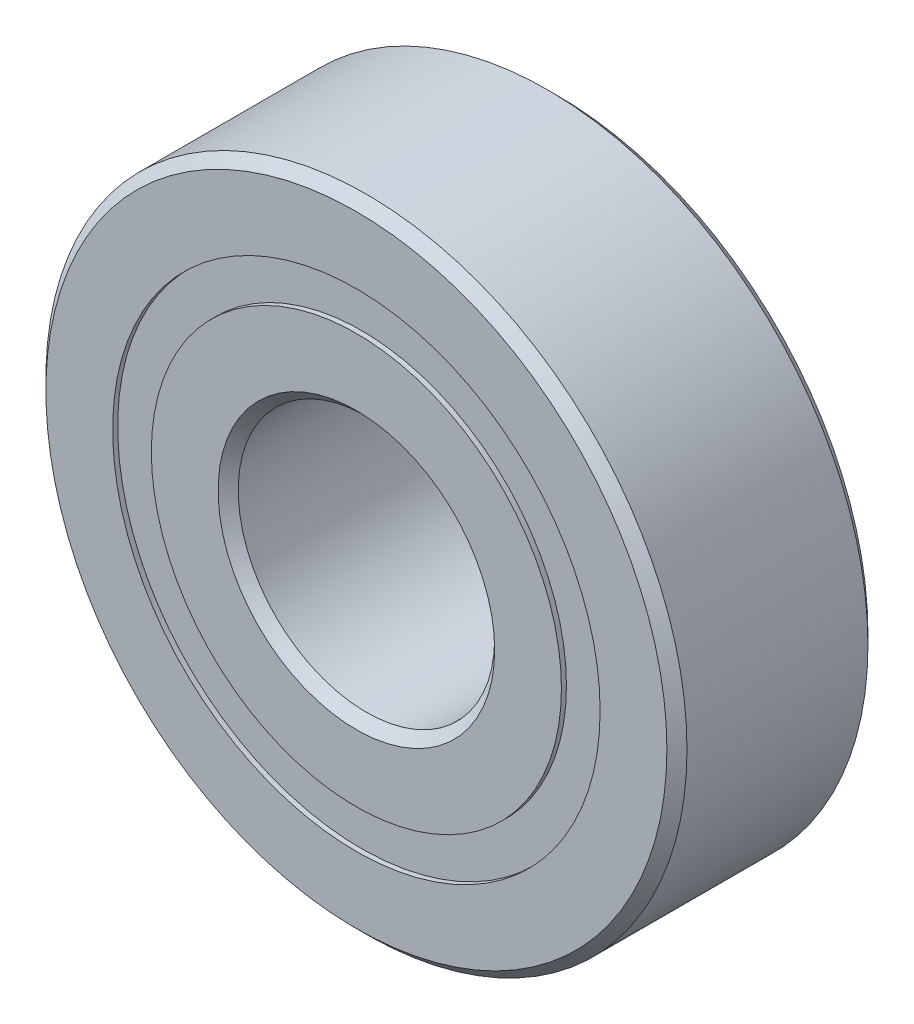
ISO-10303-21;
HEADER;
FILE_DESCRIPTION(('STEP AP214'),'2;1');
FILE_NAME('part.step','',(''),(''),'','','');
FILE_SCHEMA(('AUTOMOTIVE_DESIGN { 1 0 10303 214 1 1 1 1 }'));
ENDSEC;
DATA;
#1=APPLICATION_CONTEXT('core data for automotive mechanical design processes');
#2=APPLICATION_PROTOCOL_DEFINITION('international standard','automotive_design',2000,#1);
#3=PRODUCT_CONTEXT('',#1,'mechanical');
#4=PRODUCT('Part','Part','',(#3));
#5=PRODUCT_RELATED_PRODUCT_CATEGORY('part','',(#4));
#6=PRODUCT_DEFINITION_FORMATION('','',#4);
#7=PRODUCT_DEFINITION_CONTEXT('part definition',#1,'design');
#8=PRODUCT_DEFINITION('design','',#6,#7);
#9=PRODUCT_DEFINITION_SHAPE('','',#8);
#10=(LENGTH_UNIT() NAMED_UNIT(*) SI_UNIT(.MILLI.,.METRE.));
#11=(NAMED_UNIT(*) PLANE_ANGLE_UNIT() SI_UNIT($,.RADIAN.));
#12=(NAMED_UNIT(*) SI_UNIT($,.STERADIAN.) SOLID_ANGLE_UNIT());
#13=UNCERTAINTY_MEASURE_WITH_UNIT(LENGTH_MEASURE(1.E-05),#10,'distance_accuracy_value','');
#14=(GEOMETRIC_REPRESENTATION_CONTEXT(3) GLOBAL_UNCERTAINTY_ASSIGNED_CONTEXT((#13)) GLOBAL_UNIT_ASSIGNED_CONTEXT((#10,
#11,#12)) REPRESENTATION_CONTEXT('',''));
#15=CARTESIAN_POINT('',(0.,0.,0.));
#16=DIRECTION('',(0.,0.,1.));
#17=DIRECTION('',(1.,0.,0.));
#18=AXIS2_PLACEMENT_3D('',#15,#16,#17);
#19=CARTESIAN_POINT('',(0.,6.03522142857143,-2.36474));
#20=DIRECTION('',(0.,0.,1.));
#21=DIRECTION('',(1.,0.,0.));
#22=AXIS2_PLACEMENT_3D('',#19,#20,#21);
#23=PLANE('',#22);
#24=CARTESIAN_POINT('',(0.,0.,-2.36474));
#25=DIRECTION('',(0.,0.,1.));
#26=DIRECTION('',(1.,0.,0.));
#27=AXIS2_PLACEMENT_3D('',#24,#25,#26);
#28=CIRCLE('',#27,6.03522142857143);
#29=CARTESIAN_POINT('',(6.03522142857143,0.,-2.36474));
#30=VERTEX_POINT('',#29);
#31=EDGE_CURVE('E55',#30,#30,#28,.T.);
#32=ORIENTED_EDGE('',*,*,#31,.F.);
#33=EDGE_LOOP('',(#32));
#34=FACE_BOUND('',#33,.T.);
#35=CARTESIAN_POINT('',(0.,0.,-2.36474));
#36=DIRECTION('',(0.,0.,1.));
#37=DIRECTION('',(1.,0.,0.));
#38=AXIS2_PLACEMENT_3D('',#35,#36,#37);
#39=CIRCLE('',#38,5.07727857142857);
#40=CARTESIAN_POINT('',(5.07727857142857,0.,-2.36474));
#41=VERTEX_POINT('',#40);
#42=EDGE_CURVE('E11',#41,#41,#39,.T.);
#43=ORIENTED_EDGE('',*,*,#42,.T.);
#44=EDGE_LOOP('',(#43));
#45=FACE_BOUND('',#44,.T.);
#46=ADVANCED_FACE('F41',(#34,#45),#23,.F.);
#47=CARTESIAN_POINT('',(0.,0.,2.4892));
#48=DIRECTION('',(0.,0.,1.));
#49=DIRECTION('',(1.,0.,0.));
#50=AXIS2_PLACEMENT_3D('',#47,#48,#49);
#51=CYLINDRICAL_SURFACE('',#50,5.07727857142857);
#52=ORIENTED_EDGE('',*,*,#42,.F.);
#53=EDGE_LOOP('',(#52));
#54=FACE_BOUND('',#53,.T.);
#55=CARTESIAN_POINT('',(0.,0.,-1.20554465033679));
#56=DIRECTION('',(0.,0.,1.));
#57=DIRECTION('',(1.,0.,0.));
#58=AXIS2_PLACEMENT_3D('',#55,#56,#57);
#59=CIRCLE('',#58,5.07727857142857);
#60=CARTESIAN_POINT('',(5.07727857142857,0.,-1.20554465033679));
#61=VERTEX_POINT('',#60);
#62=EDGE_CURVE('E47',#61,#61,#59,.T.);
#63=ORIENTED_EDGE('',*,*,#62,.T.);
#64=EDGE_LOOP('',(#63));
#65=FACE_BOUND('',#64,.T.);
#66=ADVANCED_FACE('F64',(#54,#65),#51,.F.);
#67=CARTESIAN_POINT('',(0.,6.03522142857143,-1.20554465033679));
#68=DIRECTION('',(0.,0.,-1.));
#69=DIRECTION('',(-1.,0.,0.));
#70=AXIS2_PLACEMENT_3D('',#67,#68,#69);
#71=PLANE('',#70);
#72=ORIENTED_EDGE('',*,*,#62,.F.);
#73=EDGE_LOOP('',(#72));
#74=FACE_BOUND('',#73,.T.);
#75=CARTESIAN_POINT('',(0.,0.,-1.20554465033679));
#76=DIRECTION('',(0.,0.,1.));
#77=DIRECTION('',(1.,0.,0.));
#78=AXIS2_PLACEMENT_3D('',#75,#76,#77);
#79=CIRCLE('',#78,6.03522142857143);
#80=CARTESIAN_POINT('',(6.03522142857143,0.,-1.20554465033679));
#81=VERTEX_POINT('',#80);
#82=EDGE_CURVE('E51',#81,#81,#79,.T.);
#83=ORIENTED_EDGE('',*,*,#82,.T.);
#84=EDGE_LOOP('',(#83));
#85=FACE_BOUND('',#84,.T.);
#86=ADVANCED_FACE('F68',(#74,#85),#71,.F.);
#87=CARTESIAN_POINT('',(0.,0.,2.4892));
#88=DIRECTION('',(0.,0.,1.));
#89=DIRECTION('',(1.,0.,0.));
#90=AXIS2_PLACEMENT_3D('',#87,#88,#89);
#91=CYLINDRICAL_SURFACE('',#90,6.03522142857143);
#92=ORIENTED_EDGE('',*,*,#82,.F.);
#93=EDGE_LOOP('',(#92));
#94=FACE_BOUND('',#93,.T.);
#95=ORIENTED_EDGE('',*,*,#31,.T.);
#96=EDGE_LOOP('',(#95));
#97=FACE_BOUND('',#96,.T.);
#98=ADVANCED_FACE('F61',(#94,#97),#91,.T.);
#99=CLOSED_SHELL('',(#46,#66,#86,#98));
#100=MANIFOLD_SOLID_BREP('B2',#99);
#101=CARTESIAN_POINT('',(0.,6.03522142857143,2.36474));
#102=DIRECTION('',(0.,0.,-1.));
#103=DIRECTION('',(-1.,0.,0.));
#104=AXIS2_PLACEMENT_3D('',#101,#102,#103);
#105=PLANE('',#104);
#106=CARTESIAN_POINT('',(0.,0.,2.36474));
#107=DIRECTION('',(0.,0.,1.));
#108=DIRECTION('',(1.,0.,0.));
#109=AXIS2_PLACEMENT_3D('',#106,#107,#108);
#110=CIRCLE('',#109,5.07727857142857);
#111=CARTESIAN_POINT('',(5.07727857142857,0.,2.36474));
#112=VERTEX_POINT('',#111);
#113=EDGE_CURVE('E40',#112,#112,#110,.T.);
#114=ORIENTED_EDGE('',*,*,#113,.F.);
#115=EDGE_LOOP('',(#114));
#116=FACE_BOUND('',#115,.T.);
#117=CARTESIAN_POINT('',(0.,0.,2.36474));
#118=DIRECTION('',(0.,0.,1.));
#119=DIRECTION('',(1.,0.,0.));
#120=AXIS2_PLACEMENT_3D('',#117,#118,#119);
#121=CIRCLE('',#120,6.03522142857143);
#122=CARTESIAN_POINT('',(6.03522142857143,0.,2.36474));
#123=VERTEX_POINT('',#122);
#124=EDGE_CURVE('E122',#123,#123,#121,.T.);
#125=ORIENTED_EDGE('',*,*,#124,.T.);
#126=EDGE_LOOP('',(#125));
#127=FACE_BOUND('',#126,.T.);
#128=ADVANCED_FACE('F108',(#116,#127),#105,.F.);
#129=CARTESIAN_POINT('',(0.,0.,2.4892));
#130=DIRECTION('',(0.,0.,1.));
#131=DIRECTION('',(1.,0.,0.));
#132=AXIS2_PLACEMENT_3D('',#129,#130,#131);
#133=CYLINDRICAL_SURFACE('',#132,5.07727857142857);
#134=CARTESIAN_POINT('',(0.,0.,1.20554465033679));
#135=DIRECTION('',(0.,0.,1.));
#136=DIRECTION('',(1.,0.,0.));
#137=AXIS2_PLACEMENT_3D('',#134,#135,#136);
#138=CIRCLE('',#137,5.07727857142857);
#139=CARTESIAN_POINT('',(5.07727857142857,0.,1.20554465033679));
#140=VERTEX_POINT('',#139);
#141=EDGE_CURVE('E114',#140,#140,#138,.T.);
#142=ORIENTED_EDGE('',*,*,#141,.F.);
#143=EDGE_LOOP('',(#142));
#144=FACE_BOUND('',#143,.T.);
#145=ORIENTED_EDGE('',*,*,#113,.T.);
#146=EDGE_LOOP('',(#145));
#147=FACE_BOUND('',#146,.T.);
#148=ADVANCED_FACE('F137',(#144,#147),#133,.F.);
#149=CARTESIAN_POINT('',(0.,6.03522142857143,1.20554465033679));
#150=DIRECTION('',(0.,0.,1.));
#151=DIRECTION('',(1.,0.,0.));
#152=AXIS2_PLACEMENT_3D('',#149,#150,#151);
#153=PLANE('',#152);
#154=CARTESIAN_POINT('',(0.,0.,1.20554465033679));
#155=DIRECTION('',(0.,0.,1.));
#156=DIRECTION('',(1.,0.,0.));
#157=AXIS2_PLACEMENT_3D('',#154,#155,#156);
#158=CIRCLE('',#157,6.03522142857143);
#159=CARTESIAN_POINT('',(6.03522142857143,0.,1.20554465033679));
#160=VERTEX_POINT('',#159);
#161=EDGE_CURVE('E118',#160,#160,#158,.T.);
#162=ORIENTED_EDGE('',*,*,#161,.F.);
#163=EDGE_LOOP('',(#162));
#164=FACE_BOUND('',#163,.T.);
#165=ORIENTED_EDGE('',*,*,#141,.T.);
#166=EDGE_LOOP('',(#165));
#167=FACE_BOUND('',#166,.T.);
#168=ADVANCED_FACE('F132',(#164,#167),#153,.F.);
#169=CARTESIAN_POINT('',(0.,0.,2.4892));
#170=DIRECTION('',(0.,0.,1.));
#171=DIRECTION('',(1.,0.,0.));
#172=AXIS2_PLACEMENT_3D('',#169,#170,#171);
#173=CYLINDRICAL_SURFACE('',#172,6.03522142857143);
#174=ORIENTED_EDGE('',*,*,#124,.F.);
#175=EDGE_LOOP('',(#174));
#176=FACE_BOUND('',#175,.T.);
#177=ORIENTED_EDGE('',*,*,#161,.T.);
#178=EDGE_LOOP('',(#177));
#179=FACE_BOUND('',#178,.T.);
#180=ADVANCED_FACE('F129',(#176,#179),#173,.T.);
#181=CLOSED_SHELL('',(#128,#148,#168,#180));
#182=MANIFOLD_SOLID_BREP('B6',#181);
#183=CARTESIAN_POINT('',(-3.92886205296771,3.9288620529678,0.));
#184=DIRECTION('',(0.,0.,1.));
#185=DIRECTION('',(-0.707106781186539,0.707106781186556,0.));
#186=AXIS2_PLACEMENT_3D('',#183,#184,#185);
#187=SPHERICAL_SURFACE('',#186,1.20554465033679);
#188=CARTESIAN_POINT('',(-3.92886205296771,3.9288620529678,1.20554465033679));
#189=VERTEX_POINT('',#188);
#190=VERTEX_LOOP('',#189);
#191=FACE_BOUND('',#190,.T.);
#192=ADVANCED_FACE('F175',(#191),#187,.T.);
#193=CLOSED_SHELL('',(#192));
#194=MANIFOLD_SOLID_BREP('B35',#193);
#195=CARTESIAN_POINT('',(-5.55625,0.,0.));
#196=DIRECTION('',(0.,0.,1.));
#197=DIRECTION('',(-1.,0.,0.));
#198=AXIS2_PLACEMENT_3D('',#195,#196,#197);
#199=SPHERICAL_SURFACE('',#198,1.20554465033679);
#200=CARTESIAN_POINT('',(-5.55625,0.,1.20554465033679));
#201=VERTEX_POINT('',#200);
#202=VERTEX_LOOP('',#201);
#203=FACE_BOUND('',#202,.T.);
#204=ADVANCED_FACE('F195',(#203),#199,.T.);
#205=CLOSED_SHELL('',(#204));
#206=MANIFOLD_SOLID_BREP('B104',#205);
#207=CARTESIAN_POINT('',(-3.92886205296779,-3.92886205296772,0.));
#208=DIRECTION('',(0.,0.,1.));
#209=DIRECTION('',(-0.707106781186554,-0.707106781186541,0.));
#210=AXIS2_PLACEMENT_3D('',#207,#208,#209);
#211=SPHERICAL_SURFACE('',#210,1.20554465033679);
#212=CARTESIAN_POINT('',(-3.92886205296779,-3.92886205296772,1.20554465033679));
#213=VERTEX_POINT('',#212);
#214=VERTEX_LOOP('',#213);
#215=FACE_BOUND('',#214,.T.);
#216=ADVANCED_FACE('F215',(#215),#211,.T.);
#217=CLOSED_SHELL('',(#216));
#218=MANIFOLD_SOLID_BREP('B171',#217);
#219=CARTESIAN_POINT('',(0.,-5.55625,0.));
#220=DIRECTION('',(0.,0.,1.));
#221=DIRECTION('',(0.,-1.,0.));
#222=AXIS2_PLACEMENT_3D('',#219,#220,#221);
#223=SPHERICAL_SURFACE('',#222,1.20554465033679);
#224=CARTESIAN_POINT('',(0.,-5.55625,1.20554465033679));
#225=VERTEX_POINT('',#224);
#226=VERTEX_LOOP('',#225);
#227=FACE_BOUND('',#226,.T.);
#228=ADVANCED_FACE('F235',(#227),#223,.T.);
#229=CLOSED_SHELL('',(#228));
#230=MANIFOLD_SOLID_BREP('B191',#229);
#231=CARTESIAN_POINT('',(3.92886205296773,-3.92886205296778,0.));
#232=DIRECTION('',(0.,0.,1.));
#233=DIRECTION('',(0.707106781186544,-0.707106781186551,0.));
#234=AXIS2_PLACEMENT_3D('',#231,#232,#233);
#235=SPHERICAL_SURFACE('',#234,1.20554465033679);
#236=CARTESIAN_POINT('',(3.92886205296773,-3.92886205296778,1.20554465033679));
#237=VERTEX_POINT('',#236);
#238=VERTEX_LOOP('',#237);
#239=FACE_BOUND('',#238,.T.);
#240=ADVANCED_FACE('F255',(#239),#235,.T.);
#241=CLOSED_SHELL('',(#240));
#242=MANIFOLD_SOLID_BREP('B211',#241);
#243=CARTESIAN_POINT('',(5.55625,0.,0.));
#244=DIRECTION('',(0.,0.,1.));
#245=DIRECTION('',(1.,0.,0.));
#246=AXIS2_PLACEMENT_3D('',#243,#244,#245);
#247=SPHERICAL_SURFACE('',#246,1.20554465033679);
#248=CARTESIAN_POINT('',(5.55625,0.,1.20554465033679));
#249=VERTEX_POINT('',#248);
#250=VERTEX_LOOP('',#249);
#251=FACE_BOUND('',#250,.T.);
#252=ADVANCED_FACE('F275',(#251),#247,.T.);
#253=CLOSED_SHELL('',(#252));
#254=MANIFOLD_SOLID_BREP('B231',#253);
#255=CARTESIAN_POINT('',(3.92886205296776,3.92886205296775,0.));
#256=DIRECTION('',(0.,0.,1.));
#257=DIRECTION('',(0.707106781186549,0.707106781186546,0.));
#258=AXIS2_PLACEMENT_3D('',#255,#256,#257);
#259=SPHERICAL_SURFACE('',#258,1.20554465033679);
#260=CARTESIAN_POINT('',(3.92886205296776,3.92886205296775,1.20554465033679));
#261=VERTEX_POINT('',#260);
#262=VERTEX_LOOP('',#261);
#263=FACE_BOUND('',#262,.T.);
#264=ADVANCED_FACE('F295',(#263),#259,.T.);
#265=CLOSED_SHELL('',(#264));
#266=MANIFOLD_SOLID_BREP('B251',#265);
#267=CARTESIAN_POINT('',(0.,5.55625,0.));
#268=DIRECTION('',(0.,0.,1.));
#269=DIRECTION('',(0.,1.,0.));
#270=AXIS2_PLACEMENT_3D('',#267,#268,#269);
#271=SPHERICAL_SURFACE('',#270,1.20554465033679);
#272=CARTESIAN_POINT('',(0.,5.55625,1.20554465033679));
#273=VERTEX_POINT('',#272);
#274=VERTEX_LOOP('',#273);
#275=FACE_BOUND('',#274,.T.);
#276=ADVANCED_FACE('F317',(#275),#271,.T.);
#277=CLOSED_SHELL('',(#276));
#278=MANIFOLD_SOLID_BREP('B271',#277);
#279=CARTESIAN_POINT('',(0.,5.07727857142857,2.4892));
#280=DIRECTION('',(0.,0.,-1.));
#281=DIRECTION('',(-1.,0.,0.));
#282=AXIS2_PLACEMENT_3D('',#279,#280,#281);
#283=PLANE('',#282);
#284=CARTESIAN_POINT('',(0.,0.,2.4892));
#285=DIRECTION('',(0.,0.,1.));
#286=DIRECTION('',(1.,0.,0.));
#287=AXIS2_PLACEMENT_3D('',#284,#285,#286);
#288=CIRCLE('',#287,3.42392);
#289=CARTESIAN_POINT('',(3.42392,0.,2.4892));
#290=VERTEX_POINT('',#289);
#291=EDGE_CURVE('E364',#290,#290,#288,.T.);
#292=ORIENTED_EDGE('',*,*,#291,.F.);
#293=EDGE_LOOP('',(#292));
#294=FACE_BOUND('',#293,.T.);
#295=CARTESIAN_POINT('',(0.,0.,2.4892));
#296=DIRECTION('',(0.,0.,1.));
#297=DIRECTION('',(1.,0.,0.));
#298=AXIS2_PLACEMENT_3D('',#295,#296,#297);
#299=CIRCLE('',#298,5.07727857142857);
#300=CARTESIAN_POINT('',(5.07727857142857,0.,2.4892));
#301=VERTEX_POINT('',#300);
#302=EDGE_CURVE('E316',#301,#301,#299,.T.);
#303=ORIENTED_EDGE('',*,*,#302,.T.);
#304=EDGE_LOOP('',(#303));
#305=FACE_BOUND('',#304,.T.);
#306=ADVANCED_FACE('F336',(#294,#305),#283,.F.);
#307=CARTESIAN_POINT('',(0.,0.,2.4892));
#308=DIRECTION('',(0.,0.,1.));
#309=DIRECTION('',(1.,0.,0.));
#310=AXIS2_PLACEMENT_3D('',#307,#308,#309);
#311=CYLINDRICAL_SURFACE('',#310,5.07727857142857);
#312=ORIENTED_EDGE('',*,*,#302,.F.);
#313=EDGE_LOOP('',(#312));
#314=FACE_BOUND('',#313,.T.);
#315=CARTESIAN_POINT('',(0.,0.,1.10631111111111));
#316=DIRECTION('',(0.,0.,1.));
#317=DIRECTION('',(1.,0.,0.));
#318=AXIS2_PLACEMENT_3D('',#315,#316,#317);
#319=CIRCLE('',#318,5.07727857142857);
#320=CARTESIAN_POINT('',(5.07727857142857,0.,1.10631111111111));
#321=VERTEX_POINT('',#320);
#322=EDGE_CURVE('E342',#321,#321,#319,.T.);
#323=ORIENTED_EDGE('',*,*,#322,.T.);
#324=EDGE_LOOP('',(#323));
#325=FACE_BOUND('',#324,.T.);
#326=ADVANCED_FACE('F371',(#314,#325),#311,.T.);
#327=CARTESIAN_POINT('',(0.,0.,0.));
#328=DIRECTION('',(0.,0.,1.));
#329=DIRECTION('',(1.,0.,0.));
#330=AXIS2_PLACEMENT_3D('',#327,#328,#329);
#331=TOROIDAL_SURFACE('',#330,5.55625,1.20554465033679);
#332=ORIENTED_EDGE('',*,*,#322,.F.);
#333=EDGE_LOOP('',(#332));
#334=FACE_BOUND('',#333,.T.);
#335=CARTESIAN_POINT('',(0.,0.,-1.10631111111111));
#336=DIRECTION('',(0.,0.,1.));
#337=DIRECTION('',(1.,0.,0.));
#338=AXIS2_PLACEMENT_3D('',#335,#336,#337);
#339=CIRCLE('',#338,5.07727857142857);
#340=CARTESIAN_POINT('',(5.07727857142857,0.,-1.10631111111111));
#341=VERTEX_POINT('',#340);
#342=EDGE_CURVE('E346',#341,#341,#339,.T.);
#343=ORIENTED_EDGE('',*,*,#342,.T.);
#344=EDGE_LOOP('',(#343));
#345=FACE_BOUND('',#344,.T.);
#346=ADVANCED_FACE('F375',(#334,#345),#331,.F.);
#347=CARTESIAN_POINT('',(0.,0.,2.4892));
#348=DIRECTION('',(0.,0.,1.));
#349=DIRECTION('',(1.,0.,0.));
#350=AXIS2_PLACEMENT_3D('',#347,#348,#349);
#351=CYLINDRICAL_SURFACE('',#350,5.07727857142857);
#352=ORIENTED_EDGE('',*,*,#342,.F.);
#353=EDGE_LOOP('',(#352));
#354=FACE_BOUND('',#353,.T.);
#355=CARTESIAN_POINT('',(0.,0.,-2.4892));
#356=DIRECTION('',(0.,0.,1.));
#357=DIRECTION('',(1.,0.,0.));
#358=AXIS2_PLACEMENT_3D('',#355,#356,#357);
#359=CIRCLE('',#358,5.07727857142857);
#360=CARTESIAN_POINT('',(5.07727857142857,0.,-2.4892));
#361=VERTEX_POINT('',#360);
#362=EDGE_CURVE('E350',#361,#361,#359,.T.);
#363=ORIENTED_EDGE('',*,*,#362,.T.);
#364=EDGE_LOOP('',(#363));
#365=FACE_BOUND('',#364,.T.);
#366=ADVANCED_FACE('F380',(#354,#365),#351,.T.);
#367=CARTESIAN_POINT('',(0.,3.42392,-2.4892));
#368=DIRECTION('',(0.,0.,1.));
#369=DIRECTION('',(1.,0.,0.));
#370=AXIS2_PLACEMENT_3D('',#367,#368,#369);
#371=PLANE('',#370);
#372=ORIENTED_EDGE('',*,*,#362,.F.);
#373=EDGE_LOOP('',(#372));
#374=FACE_BOUND('',#373,.T.);
#375=CARTESIAN_POINT('',(0.,0.,-2.4892));
#376=DIRECTION('',(0.,0.,1.));
#377=DIRECTION('',(1.,0.,0.));
#378=AXIS2_PLACEMENT_3D('',#375,#376,#377);
#379=CIRCLE('',#378,3.42392);
#380=CARTESIAN_POINT('',(3.42392,0.,-2.4892));
#381=VERTEX_POINT('',#380);
#382=EDGE_CURVE('E355',#381,#381,#379,.T.);
#383=ORIENTED_EDGE('',*,*,#382,.T.);
#384=EDGE_LOOP('',(#383));
#385=FACE_BOUND('',#384,.T.);
#386=ADVANCED_FACE('F386',(#374,#385),#371,.F.);
#387=CARTESIAN_POINT('',(0.,0.,-2.24028));
#388=DIRECTION('',(0.,0.,-1.));
#389=DIRECTION('',(-1.,0.,0.));
#390=AXIS2_PLACEMENT_3D('',#387,#388,#389);
#391=CONICAL_SURFACE('',#390,3.175,0.785398163397447);
#392=ORIENTED_EDGE('',*,*,#382,.F.);
#393=EDGE_LOOP('',(#392));
#394=FACE_BOUND('',#393,.T.);
#395=CARTESIAN_POINT('',(0.,0.,-2.24028));
#396=DIRECTION('',(0.,0.,1.));
#397=DIRECTION('',(1.,0.,0.));
#398=AXIS2_PLACEMENT_3D('',#395,#396,#397);
#399=CIRCLE('',#398,3.175);
#400=CARTESIAN_POINT('',(3.175,0.,-2.24028));
#401=VERTEX_POINT('',#400);
#402=EDGE_CURVE('E358',#401,#401,#399,.T.);
#403=ORIENTED_EDGE('',*,*,#402,.T.);
#404=EDGE_LOOP('',(#403));
#405=FACE_BOUND('',#404,.T.);
#406=ADVANCED_FACE('F390',(#394,#405),#391,.F.);
#407=CARTESIAN_POINT('',(0.,0.,2.4892));
#408=DIRECTION('',(0.,0.,1.));
#409=DIRECTION('',(1.,0.,0.));
#410=AXIS2_PLACEMENT_3D('',#407,#408,#409);
#411=CYLINDRICAL_SURFACE('',#410,3.175);
#412=ORIENTED_EDGE('',*,*,#402,.F.);
#413=EDGE_LOOP('',(#412));
#414=FACE_BOUND('',#413,.T.);
#415=CARTESIAN_POINT('',(0.,0.,2.24028));
#416=DIRECTION('',(0.,0.,1.));
#417=DIRECTION('',(1.,0.,0.));
#418=AXIS2_PLACEMENT_3D('',#415,#416,#417);
#419=CIRCLE('',#418,3.175);
#420=CARTESIAN_POINT('',(3.175,0.,2.24028));
#421=VERTEX_POINT('',#420);
#422=EDGE_CURVE('E361',#421,#421,#419,.T.);
#423=ORIENTED_EDGE('',*,*,#422,.T.);
#424=EDGE_LOOP('',(#423));
#425=FACE_BOUND('',#424,.T.);
#426=ADVANCED_FACE('F394',(#414,#425),#411,.F.);
#427=CARTESIAN_POINT('',(0.,0.,2.4892));
#428=DIRECTION('',(0.,0.,1.));
#429=DIRECTION('',(1.,0.,0.));
#430=AXIS2_PLACEMENT_3D('',#427,#428,#429);
#431=CONICAL_SURFACE('',#430,3.42392,0.785398163397451);
#432=ORIENTED_EDGE('',*,*,#422,.F.);
#433=EDGE_LOOP('',(#432));
#434=FACE_BOUND('',#433,.T.);
#435=ORIENTED_EDGE('',*,*,#291,.T.);
#436=EDGE_LOOP('',(#435));
#437=FACE_BOUND('',#436,.T.);
#438=ADVANCED_FACE('F368',(#434,#437),#431,.F.);
#439=CLOSED_SHELL('',(#306,#326,#346,#366,#386,#406,#426,#438));
#440=MANIFOLD_SOLID_BREP('B291',#439);
#441=CARTESIAN_POINT('',(0.,0.,2.24028));
#442=DIRECTION('',(0.,0.,-1.));
#443=DIRECTION('',(-1.,0.,0.));
#444=AXIS2_PLACEMENT_3D('',#441,#442,#443);
#445=CONICAL_SURFACE('',#444,7.9375,0.785398163397447);
#446=CARTESIAN_POINT('',(0.,0.,2.4892));
#447=DIRECTION('',(0.,0.,1.));
#448=DIRECTION('',(1.,0.,0.));
#449=AXIS2_PLACEMENT_3D('',#446,#447,#448);
#450=CIRCLE('',#449,7.68858);
#451=CARTESIAN_POINT('',(7.68858,0.,2.4892));
#452=VERTEX_POINT('',#451);
#453=EDGE_CURVE('E485',#452,#452,#450,.T.);
#454=ORIENTED_EDGE('',*,*,#453,.F.);
#455=EDGE_LOOP('',(#454));
#456=FACE_BOUND('',#455,.T.);
#457=CARTESIAN_POINT('',(0.,0.,2.24028));
#458=DIRECTION('',(0.,0.,1.));
#459=DIRECTION('',(1.,0.,0.));
#460=AXIS2_PLACEMENT_3D('',#457,#458,#459);
#461=CIRCLE('',#460,7.9375);
#462=CARTESIAN_POINT('',(7.9375,0.,2.24028));
#463=VERTEX_POINT('',#462);
#464=EDGE_CURVE('E335',#463,#463,#461,.T.);
#465=ORIENTED_EDGE('',*,*,#464,.T.);
#466=EDGE_LOOP('',(#465));
#467=FACE_BOUND('',#466,.T.);
#468=ADVANCED_FACE('F457',(#456,#467),#445,.T.);
#469=CARTESIAN_POINT('',(0.,0.,2.4892));
#470=DIRECTION('',(0.,0.,1.));
#471=DIRECTION('',(1.,0.,0.));
#472=AXIS2_PLACEMENT_3D('',#469,#470,#471);
#473=CYLINDRICAL_SURFACE('',#472,7.9375);
#474=ORIENTED_EDGE('',*,*,#464,.F.);
#475=EDGE_LOOP('',(#474));
#476=FACE_BOUND('',#475,.T.);
#477=CARTESIAN_POINT('',(0.,0.,-2.24028));
#478=DIRECTION('',(0.,0.,1.));
#479=DIRECTION('',(1.,0.,0.));
#480=AXIS2_PLACEMENT_3D('',#477,#478,#479);
#481=CIRCLE('',#480,7.9375);
#482=CARTESIAN_POINT('',(7.9375,0.,-2.24028));
#483=VERTEX_POINT('',#482);
#484=EDGE_CURVE('E463',#483,#483,#481,.T.);
#485=ORIENTED_EDGE('',*,*,#484,.T.);
#486=EDGE_LOOP('',(#485));
#487=FACE_BOUND('',#486,.T.);
#488=ADVANCED_FACE('F492',(#476,#487),#473,.T.);
#489=CARTESIAN_POINT('',(0.,0.,-2.4892));
#490=DIRECTION('',(0.,0.,1.));
#491=DIRECTION('',(1.,0.,0.));
#492=AXIS2_PLACEMENT_3D('',#489,#490,#491);
#493=CONICAL_SURFACE('',#492,7.68858,0.785398163397447);
#494=ORIENTED_EDGE('',*,*,#484,.F.);
#495=EDGE_LOOP('',(#494));
#496=FACE_BOUND('',#495,.T.);
#497=CARTESIAN_POINT('',(0.,0.,-2.4892));
#498=DIRECTION('',(0.,0.,1.));
#499=DIRECTION('',(1.,0.,0.));
#500=AXIS2_PLACEMENT_3D('',#497,#498,#499);
#501=CIRCLE('',#500,7.68858);
#502=CARTESIAN_POINT('',(7.68858,0.,-2.4892));
#503=VERTEX_POINT('',#502);
#504=EDGE_CURVE('E467',#503,#503,#501,.T.);
#505=ORIENTED_EDGE('',*,*,#504,.T.);
#506=EDGE_LOOP('',(#505));
#507=FACE_BOUND('',#506,.T.);
#508=ADVANCED_FACE('F496',(#496,#507),#493,.T.);
#509=CARTESIAN_POINT('',(0.,7.68858,-2.4892));
#510=DIRECTION('',(0.,0.,1.));
#511=DIRECTION('',(1.,0.,0.));
#512=AXIS2_PLACEMENT_3D('',#509,#510,#511);
#513=PLANE('',#512);
#514=ORIENTED_EDGE('',*,*,#504,.F.);
#515=EDGE_LOOP('',(#514));
#516=FACE_BOUND('',#515,.T.);
#517=CARTESIAN_POINT('',(0.,0.,-2.4892));
#518=DIRECTION('',(0.,0.,1.));
#519=DIRECTION('',(1.,0.,0.));
#520=AXIS2_PLACEMENT_3D('',#517,#518,#519);
#521=CIRCLE('',#520,6.03522142857143);
#522=CARTESIAN_POINT('',(6.03522142857143,0.,-2.4892));
#523=VERTEX_POINT('',#522);
#524=EDGE_CURVE('E471',#523,#523,#521,.T.);
#525=ORIENTED_EDGE('',*,*,#524,.T.);
#526=EDGE_LOOP('',(#525));
#527=FACE_BOUND('',#526,.T.);
#528=ADVANCED_FACE('F501',(#516,#527),#513,.F.);
#529=CARTESIAN_POINT('',(0.,0.,2.4892));
#530=DIRECTION('',(0.,0.,1.));
#531=DIRECTION('',(1.,0.,0.));
#532=AXIS2_PLACEMENT_3D('',#529,#530,#531);
#533=CYLINDRICAL_SURFACE('',#532,6.03522142857143);
#534=ORIENTED_EDGE('',*,*,#524,.F.);
#535=EDGE_LOOP('',(#534));
#536=FACE_BOUND('',#535,.T.);
#537=CARTESIAN_POINT('',(0.,0.,-1.10631111111111));
#538=DIRECTION('',(0.,0.,1.));
#539=DIRECTION('',(1.,0.,0.));
#540=AXIS2_PLACEMENT_3D('',#537,#538,#539);
#541=CIRCLE('',#540,6.03522142857143);
#542=CARTESIAN_POINT('',(6.03522142857143,0.,-1.10631111111111));
#543=VERTEX_POINT('',#542);
#544=EDGE_CURVE('E476',#543,#543,#541,.T.);
#545=ORIENTED_EDGE('',*,*,#544,.T.);
#546=EDGE_LOOP('',(#545));
#547=FACE_BOUND('',#546,.T.);
#548=ADVANCED_FACE('F507',(#536,#547),#533,.F.);
#549=CARTESIAN_POINT('',(0.,0.,0.));
#550=DIRECTION('',(0.,0.,1.));
#551=DIRECTION('',(1.,0.,0.));
#552=AXIS2_PLACEMENT_3D('',#549,#550,#551);
#553=TOROIDAL_SURFACE('',#552,5.55625,1.20554465033679);
#554=ORIENTED_EDGE('',*,*,#544,.F.);
#555=EDGE_LOOP('',(#554));
#556=FACE_BOUND('',#555,.T.);
#557=CARTESIAN_POINT('',(0.,0.,1.10631111111111));
#558=DIRECTION('',(0.,0.,1.));
#559=DIRECTION('',(1.,0.,0.));
#560=AXIS2_PLACEMENT_3D('',#557,#558,#559);
#561=CIRCLE('',#560,6.03522142857143);
#562=CARTESIAN_POINT('',(6.03522142857143,0.,1.10631111111111));
#563=VERTEX_POINT('',#562);
#564=EDGE_CURVE('E479',#563,#563,#561,.T.);
#565=ORIENTED_EDGE('',*,*,#564,.T.);
#566=EDGE_LOOP('',(#565));
#567=FACE_BOUND('',#566,.T.);
#568=ADVANCED_FACE('F511',(#556,#567),#553,.F.);
#569=CARTESIAN_POINT('',(0.,0.,2.4892));
#570=DIRECTION('',(0.,0.,1.));
#571=DIRECTION('',(1.,0.,0.));
#572=AXIS2_PLACEMENT_3D('',#569,#570,#571);
#573=CYLINDRICAL_SURFACE('',#572,6.03522142857143);
#574=ORIENTED_EDGE('',*,*,#564,.F.);
#575=EDGE_LOOP('',(#574));
#576=FACE_BOUND('',#575,.T.);
#577=CARTESIAN_POINT('',(0.,0.,2.4892));
#578=DIRECTION('',(0.,0.,1.));
#579=DIRECTION('',(1.,0.,0.));
#580=AXIS2_PLACEMENT_3D('',#577,#578,#579);
#581=CIRCLE('',#580,6.03522142857143);
#582=CARTESIAN_POINT('',(6.03522142857143,0.,2.4892));
#583=VERTEX_POINT('',#582);
#584=EDGE_CURVE('E482',#583,#583,#581,.T.);
#585=ORIENTED_EDGE('',*,*,#584,.T.);
#586=EDGE_LOOP('',(#585));
#587=FACE_BOUND('',#586,.T.);
#588=ADVANCED_FACE('F515',(#576,#587),#573,.F.);
#589=CARTESIAN_POINT('',(0.,7.68858,2.4892));
#590=DIRECTION('',(0.,0.,-1.));
#591=DIRECTION('',(-1.,0.,0.));
#592=AXIS2_PLACEMENT_3D('',#589,#590,#591);
#593=PLANE('',#592);
#594=ORIENTED_EDGE('',*,*,#584,.F.);
#595=EDGE_LOOP('',(#594));
#596=FACE_BOUND('',#595,.T.);
#597=ORIENTED_EDGE('',*,*,#453,.T.);
#598=EDGE_LOOP('',(#597));
#599=FACE_BOUND('',#598,.T.);
#600=ADVANCED_FACE('F489',(#596,#599),#593,.F.);
#601=CLOSED_SHELL('',(#468,#488,#508,#528,#548,#568,#588,#600));
#602=MANIFOLD_SOLID_BREP('B311',#601);
#603=ADVANCED_BREP_SHAPE_REPRESENTATION('',(#18,#100,#182,#194,#206,#218,#230,#242,#254,#266,
#278,#440,#602),#14);
#604=SHAPE_DEFINITION_REPRESENTATION(#9,#603);
ENDSEC;
END-ISO-10303-21;
